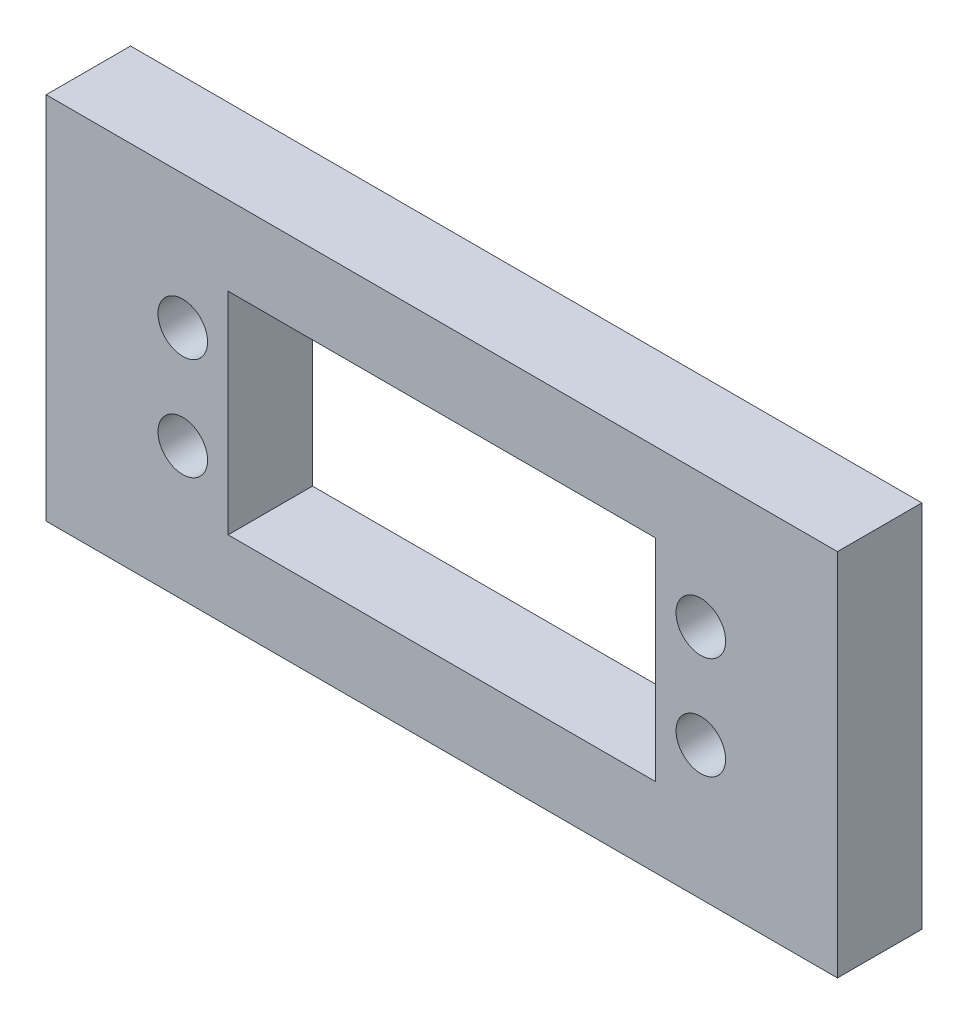
ISO-10303-21;
HEADER;
FILE_DESCRIPTION(('STEP AP214'),'2;1');
FILE_NAME('part.step','',(''),(''),'','','');
FILE_SCHEMA(('AUTOMOTIVE_DESIGN { 1 0 10303 214 1 1 1 1 }'));
ENDSEC;
DATA;
#1=APPLICATION_CONTEXT('core data for automotive mechanical design processes');
#2=APPLICATION_PROTOCOL_DEFINITION('international standard','automotive_design',2000,#1);
#3=PRODUCT_CONTEXT('',#1,'mechanical');
#4=PRODUCT('Part','Part','',(#3));
#5=PRODUCT_RELATED_PRODUCT_CATEGORY('part','',(#4));
#6=PRODUCT_DEFINITION_FORMATION('','',#4);
#7=PRODUCT_DEFINITION_CONTEXT('part definition',#1,'design');
#8=PRODUCT_DEFINITION('design','',#6,#7);
#9=PRODUCT_DEFINITION_SHAPE('','',#8);
#10=(LENGTH_UNIT() NAMED_UNIT(*) SI_UNIT(.MILLI.,.METRE.));
#11=(NAMED_UNIT(*) PLANE_ANGLE_UNIT() SI_UNIT($,.RADIAN.));
#12=(NAMED_UNIT(*) SI_UNIT($,.STERADIAN.) SOLID_ANGLE_UNIT());
#13=UNCERTAINTY_MEASURE_WITH_UNIT(LENGTH_MEASURE(1.E-05),#10,'distance_accuracy_value','');
#14=(GEOMETRIC_REPRESENTATION_CONTEXT(3) GLOBAL_UNCERTAINTY_ASSIGNED_CONTEXT((#13)) GLOBAL_UNIT_ASSIGNED_CONTEXT((#10,
#11,#12)) REPRESENTATION_CONTEXT('',''));
#15=CARTESIAN_POINT('',(0.,0.,0.));
#16=DIRECTION('',(0.,0.,1.));
#17=DIRECTION('',(1.,0.,0.));
#18=AXIS2_PLACEMENT_3D('',#15,#16,#17);
#19=CARTESIAN_POINT('',(0.,0.,8.));
#20=DIRECTION('',(0.,0.,1.));
#21=DIRECTION('',(1.,0.,0.));
#22=AXIS2_PLACEMENT_3D('',#19,#20,#21);
#23=PLANE('',#22);
#24=DIRECTION('',(0.,1.,0.));
#25=VECTOR('',#24,1.);
#26=CARTESIAN_POINT('',(37.5,-41.,8.));
#27=LINE('',#26,#25);
#28=CARTESIAN_POINT('',(37.5,-76.,8.));
#29=VERTEX_POINT('',#28);
#30=CARTESIAN_POINT('',(37.5,-41.,8.));
#31=VERTEX_POINT('',#30);
#32=EDGE_CURVE('E156',#29,#31,#27,.T.);
#33=ORIENTED_EDGE('',*,*,#32,.T.);
#34=DIRECTION('',(-1.,0.,0.));
#35=VECTOR('',#34,1.);
#36=CARTESIAN_POINT('',(-32.5,-41.,8.));
#37=LINE('',#36,#35);
#38=CARTESIAN_POINT('',(-37.5,-41.,8.));
#39=VERTEX_POINT('',#38);
#40=EDGE_CURVE('E151',#31,#39,#37,.T.);
#41=ORIENTED_EDGE('',*,*,#40,.T.);
#42=DIRECTION('',(0.,-1.,0.));
#43=VECTOR('',#42,1.);
#44=CARTESIAN_POINT('',(-37.5,-41.,8.));
#45=LINE('',#44,#43);
#46=CARTESIAN_POINT('',(-37.5,-76.,8.));
#47=VERTEX_POINT('',#46);
#48=EDGE_CURVE('E166',#39,#47,#45,.T.);
#49=ORIENTED_EDGE('',*,*,#48,.T.);
#50=DIRECTION('',(1.,0.,0.));
#51=VECTOR('',#50,1.);
#52=CARTESIAN_POINT('',(-37.5,-76.,8.));
#53=LINE('',#52,#51);
#54=EDGE_CURVE('E169',#47,#29,#53,.T.);
#55=ORIENTED_EDGE('',*,*,#54,.T.);
#56=EDGE_LOOP('',(#33,#41,#49,#55));
#57=FACE_BOUND('',#56,.T.);
#58=CARTESIAN_POINT('',(-24.55,-63.35,8.));
#59=DIRECTION('',(0.,0.,1.));
#60=DIRECTION('',(1.,0.,0.));
#61=AXIS2_PLACEMENT_3D('',#58,#59,#60);
#62=CIRCLE('',#61,2.35);
#63=CARTESIAN_POINT('',(-22.2,-63.35,8.));
#64=VERTEX_POINT('',#63);
#65=EDGE_CURVE('E135',#64,#64,#62,.T.);
#66=ORIENTED_EDGE('',*,*,#65,.F.);
#67=EDGE_LOOP('',(#66));
#68=FACE_BOUND('',#67,.T.);
#69=CARTESIAN_POINT('',(24.55,-63.35,8.));
#70=DIRECTION('',(0.,0.,1.));
#71=DIRECTION('',(1.,0.,0.));
#72=AXIS2_PLACEMENT_3D('',#69,#70,#71);
#73=CIRCLE('',#72,2.35);
#74=CARTESIAN_POINT('',(26.9,-63.35,8.));
#75=VERTEX_POINT('',#74);
#76=EDGE_CURVE('E136',#75,#75,#73,.T.);
#77=ORIENTED_EDGE('',*,*,#76,.F.);
#78=EDGE_LOOP('',(#77));
#79=FACE_BOUND('',#78,.T.);
#80=CARTESIAN_POINT('',(24.55,-53.65,8.));
#81=DIRECTION('',(0.,0.,1.));
#82=DIRECTION('',(1.,0.,0.));
#83=AXIS2_PLACEMENT_3D('',#80,#81,#82);
#84=CIRCLE('',#83,2.35);
#85=CARTESIAN_POINT('',(26.9,-53.65,8.));
#86=VERTEX_POINT('',#85);
#87=EDGE_CURVE('E143',#86,#86,#84,.T.);
#88=ORIENTED_EDGE('',*,*,#87,.F.);
#89=EDGE_LOOP('',(#88));
#90=FACE_BOUND('',#89,.T.);
#91=DIRECTION('',(0.,-1.,0.));
#92=VECTOR('',#91,1.);
#93=CARTESIAN_POINT('',(-20.25,-48.5,8.));
#94=LINE('',#93,#92);
#95=CARTESIAN_POINT('',(-20.25,-48.5,8.));
#96=VERTEX_POINT('',#95);
#97=CARTESIAN_POINT('',(-20.25,-68.5,8.));
#98=VERTEX_POINT('',#97);
#99=EDGE_CURVE('E58',#96,#98,#94,.T.);
#100=ORIENTED_EDGE('',*,*,#99,.F.);
#101=DIRECTION('',(-1.,0.,0.));
#102=VECTOR('',#101,1.);
#103=CARTESIAN_POINT('',(-20.25,-48.5,8.));
#104=LINE('',#103,#102);
#105=CARTESIAN_POINT('',(20.25,-48.5,8.));
#106=VERTEX_POINT('',#105);
#107=EDGE_CURVE('E114',#106,#96,#104,.T.);
#108=ORIENTED_EDGE('',*,*,#107,.F.);
#109=DIRECTION('',(0.,1.,0.));
#110=VECTOR('',#109,1.);
#111=CARTESIAN_POINT('',(20.25,-48.5,8.));
#112=LINE('',#111,#110);
#113=CARTESIAN_POINT('',(20.25,-68.5,8.));
#114=VERTEX_POINT('',#113);
#115=EDGE_CURVE('E229',#114,#106,#112,.T.);
#116=ORIENTED_EDGE('',*,*,#115,.F.);
#117=DIRECTION('',(1.,0.,0.));
#118=VECTOR('',#117,1.);
#119=CARTESIAN_POINT('',(-20.25,-68.5,8.));
#120=LINE('',#119,#118);
#121=EDGE_CURVE('E232',#98,#114,#120,.T.);
#122=ORIENTED_EDGE('',*,*,#121,.F.);
#123=EDGE_LOOP('',(#100,#108,#116,#122));
#124=FACE_BOUND('',#123,.T.);
#125=CARTESIAN_POINT('',(-24.55,-53.65,8.));
#126=DIRECTION('',(0.,0.,1.));
#127=DIRECTION('',(1.,0.,0.));
#128=AXIS2_PLACEMENT_3D('',#125,#126,#127);
#129=CIRCLE('',#128,2.35);
#130=CARTESIAN_POINT('',(-22.2,-53.65,8.));
#131=VERTEX_POINT('',#130);
#132=EDGE_CURVE('E139',#131,#131,#129,.T.);
#133=ORIENTED_EDGE('',*,*,#132,.F.);
#134=EDGE_LOOP('',(#133));
#135=FACE_BOUND('',#134,.T.);
#136=ADVANCED_FACE('F41',(#57,#68,#79,#90,#124,#135),#23,.T.);
#137=CARTESIAN_POINT('',(0.,0.,0.));
#138=DIRECTION('',(0.,0.,1.));
#139=DIRECTION('',(1.,0.,0.));
#140=AXIS2_PLACEMENT_3D('',#137,#138,#139);
#141=PLANE('',#140);
#142=CARTESIAN_POINT('',(-24.55,-63.35,0.));
#143=DIRECTION('',(0.,0.,1.));
#144=DIRECTION('',(1.,0.,0.));
#145=AXIS2_PLACEMENT_3D('',#142,#143,#144);
#146=CIRCLE('',#145,2.35);
#147=CARTESIAN_POINT('',(-22.2,-63.35,0.));
#148=VERTEX_POINT('',#147);
#149=EDGE_CURVE('E132',#148,#148,#146,.F.);
#150=ORIENTED_EDGE('',*,*,#149,.F.);
#151=EDGE_LOOP('',(#150));
#152=FACE_BOUND('',#151,.T.);
#153=CARTESIAN_POINT('',(24.55,-63.35,0.));
#154=DIRECTION('',(0.,0.,1.));
#155=DIRECTION('',(1.,0.,0.));
#156=AXIS2_PLACEMENT_3D('',#153,#154,#155);
#157=CIRCLE('',#156,2.35);
#158=CARTESIAN_POINT('',(26.9,-63.35,0.));
#159=VERTEX_POINT('',#158);
#160=EDGE_CURVE('E140',#159,#159,#157,.F.);
#161=ORIENTED_EDGE('',*,*,#160,.F.);
#162=EDGE_LOOP('',(#161));
#163=FACE_BOUND('',#162,.T.);
#164=CARTESIAN_POINT('',(24.55,-53.65,0.));
#165=DIRECTION('',(0.,0.,1.));
#166=DIRECTION('',(1.,0.,0.));
#167=AXIS2_PLACEMENT_3D('',#164,#165,#166);
#168=CIRCLE('',#167,2.35);
#169=CARTESIAN_POINT('',(26.9,-53.65,0.));
#170=VERTEX_POINT('',#169);
#171=EDGE_CURVE('E128',#170,#170,#168,.F.);
#172=ORIENTED_EDGE('',*,*,#171,.F.);
#173=EDGE_LOOP('',(#172));
#174=FACE_BOUND('',#173,.T.);
#175=DIRECTION('',(1.,0.,0.));
#176=VECTOR('',#175,1.);
#177=CARTESIAN_POINT('',(-20.25,-48.5,0.));
#178=LINE('',#177,#176);
#179=CARTESIAN_POINT('',(-20.25,-48.5,0.));
#180=VERTEX_POINT('',#179);
#181=CARTESIAN_POINT('',(20.25,-48.5,0.));
#182=VERTEX_POINT('',#181);
#183=EDGE_CURVE('E112',#180,#182,#178,.T.);
#184=ORIENTED_EDGE('',*,*,#183,.F.);
#185=DIRECTION('',(0.,1.,0.));
#186=VECTOR('',#185,1.);
#187=CARTESIAN_POINT('',(-20.25,-48.5,0.));
#188=LINE('',#187,#186);
#189=CARTESIAN_POINT('',(-20.25,-68.5,0.));
#190=VERTEX_POINT('',#189);
#191=EDGE_CURVE('E119',#190,#180,#188,.T.);
#192=ORIENTED_EDGE('',*,*,#191,.F.);
#193=DIRECTION('',(-1.,0.,0.));
#194=VECTOR('',#193,1.);
#195=CARTESIAN_POINT('',(-20.25,-68.5,0.));
#196=LINE('',#195,#194);
#197=CARTESIAN_POINT('',(20.25,-68.5,0.));
#198=VERTEX_POINT('',#197);
#199=EDGE_CURVE('E116',#198,#190,#196,.T.);
#200=ORIENTED_EDGE('',*,*,#199,.F.);
#201=DIRECTION('',(0.,-1.,0.));
#202=VECTOR('',#201,1.);
#203=CARTESIAN_POINT('',(20.25,-48.5,0.));
#204=LINE('',#203,#202);
#205=EDGE_CURVE('E66',#182,#198,#204,.T.);
#206=ORIENTED_EDGE('',*,*,#205,.F.);
#207=EDGE_LOOP('',(#184,#192,#200,#206));
#208=FACE_BOUND('',#207,.T.);
#209=CARTESIAN_POINT('',(-24.55,-53.65,0.));
#210=DIRECTION('',(0.,0.,1.));
#211=DIRECTION('',(1.,0.,0.));
#212=AXIS2_PLACEMENT_3D('',#209,#210,#211);
#213=CIRCLE('',#212,2.35);
#214=CARTESIAN_POINT('',(-22.2,-53.65,0.));
#215=VERTEX_POINT('',#214);
#216=EDGE_CURVE('E148',#215,#215,#213,.F.);
#217=ORIENTED_EDGE('',*,*,#216,.F.);
#218=EDGE_LOOP('',(#217));
#219=FACE_BOUND('',#218,.T.);
#220=DIRECTION('',(-1.,0.,0.));
#221=VECTOR('',#220,1.);
#222=CARTESIAN_POINT('',(17.5,-41.,0.));
#223=LINE('',#222,#221);
#224=CARTESIAN_POINT('',(37.5,-41.,0.));
#225=VERTEX_POINT('',#224);
#226=CARTESIAN_POINT('',(-37.5,-41.,0.));
#227=VERTEX_POINT('',#226);
#228=EDGE_CURVE('E162',#225,#227,#223,.T.);
#229=ORIENTED_EDGE('',*,*,#228,.F.);
#230=DIRECTION('',(0.,1.,0.));
#231=VECTOR('',#230,1.);
#232=CARTESIAN_POINT('',(37.5,-41.,0.));
#233=LINE('',#232,#231);
#234=CARTESIAN_POINT('',(37.5,-76.,0.));
#235=VERTEX_POINT('',#234);
#236=EDGE_CURVE('E159',#235,#225,#233,.T.);
#237=ORIENTED_EDGE('',*,*,#236,.F.);
#238=DIRECTION('',(1.,0.,0.));
#239=VECTOR('',#238,1.);
#240=CARTESIAN_POINT('',(-37.5,-76.,0.));
#241=LINE('',#240,#239);
#242=CARTESIAN_POINT('',(-37.5,-76.,0.));
#243=VERTEX_POINT('',#242);
#244=EDGE_CURVE('E155',#243,#235,#241,.T.);
#245=ORIENTED_EDGE('',*,*,#244,.F.);
#246=DIRECTION('',(0.,-1.,0.));
#247=VECTOR('',#246,1.);
#248=CARTESIAN_POINT('',(-37.5,-41.,0.));
#249=LINE('',#248,#247);
#250=EDGE_CURVE('E152',#227,#243,#249,.T.);
#251=ORIENTED_EDGE('',*,*,#250,.F.);
#252=EDGE_LOOP('',(#229,#237,#245,#251));
#253=FACE_BOUND('',#252,.T.);
#254=ADVANCED_FACE('F43',(#152,#163,#174,#208,#219,#253),#141,.F.);
#255=CARTESIAN_POINT('',(17.5,-41.,0.));
#256=DIRECTION('',(0.,1.,0.));
#257=DIRECTION('',(-1.,0.,0.));
#258=AXIS2_PLACEMENT_3D('',#255,#256,#257);
#259=PLANE('',#258);
#260=ORIENTED_EDGE('',*,*,#40,.F.);
#261=DIRECTION('',(0.,0.,1.));
#262=VECTOR('',#261,1.);
#263=CARTESIAN_POINT('',(37.5,-41.,0.));
#264=LINE('',#263,#262);
#265=EDGE_CURVE('E11',#225,#31,#264,.T.);
#266=ORIENTED_EDGE('',*,*,#265,.F.);
#267=ORIENTED_EDGE('',*,*,#228,.T.);
#268=DIRECTION('',(0.,0.,1.));
#269=VECTOR('',#268,1.);
#270=CARTESIAN_POINT('',(-37.5,-41.,0.));
#271=LINE('',#270,#269);
#272=EDGE_CURVE('E45',#227,#39,#271,.T.);
#273=ORIENTED_EDGE('',*,*,#272,.T.);
#274=EDGE_LOOP('',(#260,#266,#267,#273));
#275=FACE_BOUND('',#274,.T.);
#276=ADVANCED_FACE('F180',(#275),#259,.T.);
#277=CARTESIAN_POINT('',(37.5,-41.,0.));
#278=DIRECTION('',(1.,0.,0.));
#279=DIRECTION('',(0.,0.,-1.));
#280=AXIS2_PLACEMENT_3D('',#277,#278,#279);
#281=PLANE('',#280);
#282=ORIENTED_EDGE('',*,*,#32,.F.);
#283=DIRECTION('',(0.,0.,1.));
#284=VECTOR('',#283,1.);
#285=CARTESIAN_POINT('',(37.5,-76.,0.));
#286=LINE('',#285,#284);
#287=EDGE_CURVE('E50',#235,#29,#286,.T.);
#288=ORIENTED_EDGE('',*,*,#287,.F.);
#289=ORIENTED_EDGE('',*,*,#236,.T.);
#290=ORIENTED_EDGE('',*,*,#265,.T.);
#291=EDGE_LOOP('',(#282,#288,#289,#290));
#292=FACE_BOUND('',#291,.T.);
#293=ADVANCED_FACE('F188',(#292),#281,.T.);
#294=CARTESIAN_POINT('',(-37.5,-76.,0.));
#295=DIRECTION('',(0.,-1.,0.));
#296=DIRECTION('',(1.,0.,0.));
#297=AXIS2_PLACEMENT_3D('',#294,#295,#296);
#298=PLANE('',#297);
#299=ORIENTED_EDGE('',*,*,#54,.F.);
#300=DIRECTION('',(0.,0.,1.));
#301=VECTOR('',#300,1.);
#302=CARTESIAN_POINT('',(-37.5,-76.,0.));
#303=LINE('',#302,#301);
#304=EDGE_CURVE('E174',#243,#47,#303,.T.);
#305=ORIENTED_EDGE('',*,*,#304,.F.);
#306=ORIENTED_EDGE('',*,*,#244,.T.);
#307=ORIENTED_EDGE('',*,*,#287,.T.);
#308=EDGE_LOOP('',(#299,#305,#306,#307));
#309=FACE_BOUND('',#308,.T.);
#310=ADVANCED_FACE('F193',(#309),#298,.T.);
#311=CARTESIAN_POINT('',(-37.5,-41.,0.));
#312=DIRECTION('',(-1.,0.,0.));
#313=DIRECTION('',(0.,0.,1.));
#314=AXIS2_PLACEMENT_3D('',#311,#312,#313);
#315=PLANE('',#314);
#316=ORIENTED_EDGE('',*,*,#48,.F.);
#317=ORIENTED_EDGE('',*,*,#272,.F.);
#318=ORIENTED_EDGE('',*,*,#250,.T.);
#319=ORIENTED_EDGE('',*,*,#304,.T.);
#320=EDGE_LOOP('',(#316,#317,#318,#319));
#321=FACE_BOUND('',#320,.T.);
#322=ADVANCED_FACE('F183',(#321),#315,.T.);
#323=CARTESIAN_POINT('',(-24.55,-53.65,-0.000999999999999265));
#324=DIRECTION('',(0.,0.,1.));
#325=DIRECTION('',(1.,0.,0.));
#326=AXIS2_PLACEMENT_3D('',#323,#324,#325);
#327=CYLINDRICAL_SURFACE('',#326,2.35);
#328=ORIENTED_EDGE('',*,*,#132,.T.);
#329=EDGE_LOOP('',(#328));
#330=FACE_BOUND('',#329,.T.);
#331=ORIENTED_EDGE('',*,*,#216,.T.);
#332=EDGE_LOOP('',(#331));
#333=FACE_BOUND('',#332,.T.);
#334=ADVANCED_FACE('F200',(#330,#333),#327,.F.);
#335=CARTESIAN_POINT('',(-20.25,-48.5,-0.000999999999999265));
#336=DIRECTION('',(-1.,0.,0.));
#337=DIRECTION('',(0.,-1.,0.));
#338=AXIS2_PLACEMENT_3D('',#335,#336,#337);
#339=PLANE('',#338);
#340=ORIENTED_EDGE('',*,*,#191,.T.);
#341=DIRECTION('',(0.,0.,1.));
#342=VECTOR('',#341,1.);
#343=CARTESIAN_POINT('',(-20.25,-48.5,-0.000999999999999265));
#344=LINE('',#343,#342);
#345=EDGE_CURVE('E108',#180,#96,#344,.T.);
#346=ORIENTED_EDGE('',*,*,#345,.T.);
#347=ORIENTED_EDGE('',*,*,#99,.T.);
#348=DIRECTION('',(0.,0.,1.));
#349=VECTOR('',#348,1.);
#350=CARTESIAN_POINT('',(-20.25,-68.5,-0.000999999999999265));
#351=LINE('',#350,#349);
#352=EDGE_CURVE('E121',#190,#98,#351,.T.);
#353=ORIENTED_EDGE('',*,*,#352,.F.);
#354=EDGE_LOOP('',(#340,#346,#347,#353));
#355=FACE_BOUND('',#354,.T.);
#356=ADVANCED_FACE('F120',(#355),#339,.F.);
#357=CARTESIAN_POINT('',(-20.25,-48.5,-0.000999999999999265));
#358=DIRECTION('',(0.,1.,0.));
#359=DIRECTION('',(0.,0.,1.));
#360=AXIS2_PLACEMENT_3D('',#357,#358,#359);
#361=PLANE('',#360);
#362=ORIENTED_EDGE('',*,*,#183,.T.);
#363=DIRECTION('',(0.,0.,1.));
#364=VECTOR('',#363,1.);
#365=CARTESIAN_POINT('',(20.25,-48.5,-0.000999999999999265));
#366=LINE('',#365,#364);
#367=EDGE_CURVE('E115',#182,#106,#366,.T.);
#368=ORIENTED_EDGE('',*,*,#367,.T.);
#369=ORIENTED_EDGE('',*,*,#107,.T.);
#370=ORIENTED_EDGE('',*,*,#345,.F.);
#371=EDGE_LOOP('',(#362,#368,#369,#370));
#372=FACE_BOUND('',#371,.T.);
#373=ADVANCED_FACE('F110',(#372),#361,.F.);
#374=CARTESIAN_POINT('',(20.25,-48.5,-0.000999999999999265));
#375=DIRECTION('',(1.,0.,0.));
#376=DIRECTION('',(0.,1.,0.));
#377=AXIS2_PLACEMENT_3D('',#374,#375,#376);
#378=PLANE('',#377);
#379=ORIENTED_EDGE('',*,*,#205,.T.);
#380=DIRECTION('',(0.,0.,1.));
#381=VECTOR('',#380,1.);
#382=CARTESIAN_POINT('',(20.25,-68.5,-0.000999999999999265));
#383=LINE('',#382,#381);
#384=EDGE_CURVE('E225',#198,#114,#383,.T.);
#385=ORIENTED_EDGE('',*,*,#384,.T.);
#386=ORIENTED_EDGE('',*,*,#115,.T.);
#387=ORIENTED_EDGE('',*,*,#367,.F.);
#388=EDGE_LOOP('',(#379,#385,#386,#387));
#389=FACE_BOUND('',#388,.T.);
#390=ADVANCED_FACE('F240',(#389),#378,.F.);
#391=CARTESIAN_POINT('',(-20.25,-68.5,-0.000999999999999265));
#392=DIRECTION('',(0.,-1.,0.));
#393=DIRECTION('',(0.,0.,-1.));
#394=AXIS2_PLACEMENT_3D('',#391,#392,#393);
#395=PLANE('',#394);
#396=ORIENTED_EDGE('',*,*,#199,.T.);
#397=ORIENTED_EDGE('',*,*,#352,.T.);
#398=ORIENTED_EDGE('',*,*,#121,.T.);
#399=ORIENTED_EDGE('',*,*,#384,.F.);
#400=EDGE_LOOP('',(#396,#397,#398,#399));
#401=FACE_BOUND('',#400,.T.);
#402=ADVANCED_FACE('F237',(#401),#395,.F.);
#403=CARTESIAN_POINT('',(24.55,-53.65,-0.000999999999999265));
#404=DIRECTION('',(0.,0.,1.));
#405=DIRECTION('',(1.,0.,0.));
#406=AXIS2_PLACEMENT_3D('',#403,#404,#405);
#407=CYLINDRICAL_SURFACE('',#406,2.35);
#408=ORIENTED_EDGE('',*,*,#87,.T.);
#409=EDGE_LOOP('',(#408));
#410=FACE_BOUND('',#409,.T.);
#411=ORIENTED_EDGE('',*,*,#171,.T.);
#412=EDGE_LOOP('',(#411));
#413=FACE_BOUND('',#412,.T.);
#414=ADVANCED_FACE('F247',(#410,#413),#407,.F.);
#415=CARTESIAN_POINT('',(24.55,-63.35,-0.000999999999999265));
#416=DIRECTION('',(0.,0.,1.));
#417=DIRECTION('',(1.,0.,0.));
#418=AXIS2_PLACEMENT_3D('',#415,#416,#417);
#419=CYLINDRICAL_SURFACE('',#418,2.35);
#420=ORIENTED_EDGE('',*,*,#76,.T.);
#421=EDGE_LOOP('',(#420));
#422=FACE_BOUND('',#421,.T.);
#423=ORIENTED_EDGE('',*,*,#160,.T.);
#424=EDGE_LOOP('',(#423));
#425=FACE_BOUND('',#424,.T.);
#426=ADVANCED_FACE('F255',(#422,#425),#419,.F.);
#427=CARTESIAN_POINT('',(-24.55,-63.35,-0.000999999999999265));
#428=DIRECTION('',(0.,0.,1.));
#429=DIRECTION('',(1.,0.,0.));
#430=AXIS2_PLACEMENT_3D('',#427,#428,#429);
#431=CYLINDRICAL_SURFACE('',#430,2.35);
#432=ORIENTED_EDGE('',*,*,#65,.T.);
#433=EDGE_LOOP('',(#432));
#434=FACE_BOUND('',#433,.T.);
#435=ORIENTED_EDGE('',*,*,#149,.T.);
#436=EDGE_LOOP('',(#435));
#437=FACE_BOUND('',#436,.T.);
#438=ADVANCED_FACE('F252',(#434,#437),#431,.F.);
#439=CLOSED_SHELL('',(#136,#254,#276,#293,#310,#322,#334,#356,#373,#390,#402,#414,#426,#438));
#440=MANIFOLD_SOLID_BREP('B2',#439);
#441=ADVANCED_BREP_SHAPE_REPRESENTATION('',(#18,#440),#14);
#442=SHAPE_DEFINITION_REPRESENTATION(#9,#441);
ENDSEC;
END-ISO-10303-21;
